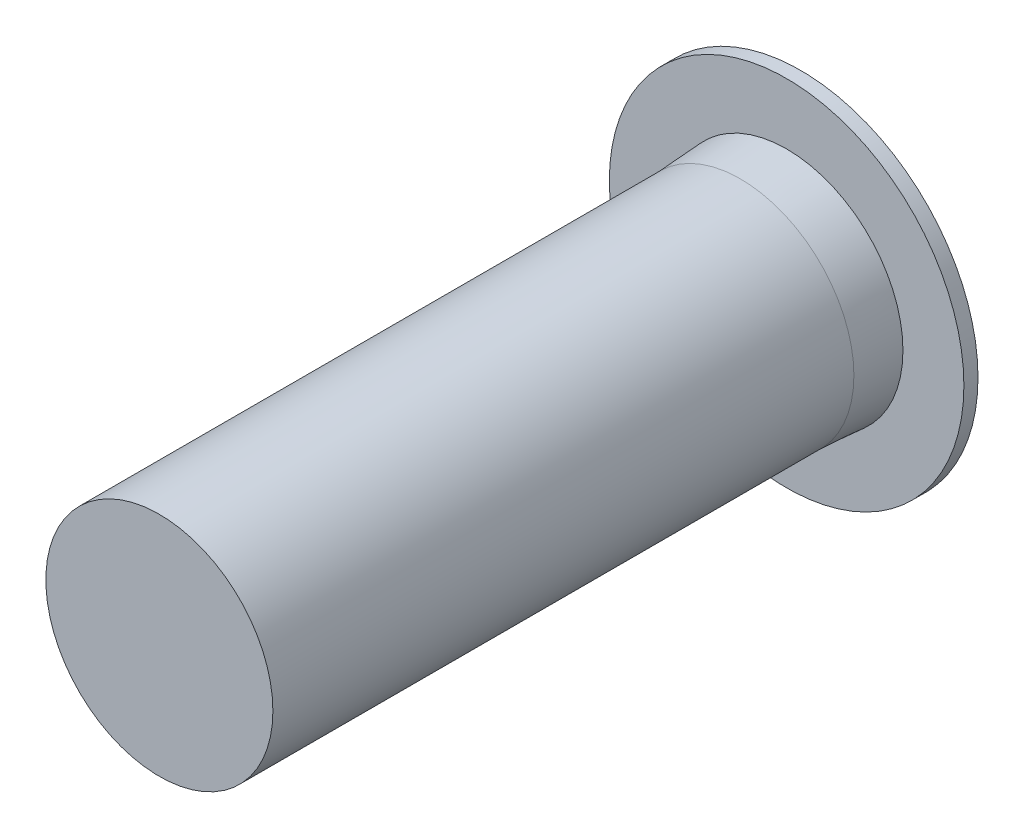
ISO-10303-21;
HEADER;
FILE_DESCRIPTION(('STEP AP214'),'2;1');
FILE_NAME('part.step','',(''),(''),'','','');
FILE_SCHEMA(('AUTOMOTIVE_DESIGN { 1 0 10303 214 1 1 1 1 }'));
ENDSEC;
DATA;
#1=APPLICATION_CONTEXT('core data for automotive mechanical design processes');
#2=APPLICATION_PROTOCOL_DEFINITION('international standard','automotive_design',2000,#1);
#3=PRODUCT_CONTEXT('',#1,'mechanical');
#4=PRODUCT('Part','Part','',(#3));
#5=PRODUCT_RELATED_PRODUCT_CATEGORY('part','',(#4));
#6=PRODUCT_DEFINITION_FORMATION('','',#4);
#7=PRODUCT_DEFINITION_CONTEXT('part definition',#1,'design');
#8=PRODUCT_DEFINITION('design','',#6,#7);
#9=PRODUCT_DEFINITION_SHAPE('','',#8);
#10=(LENGTH_UNIT() NAMED_UNIT(*) SI_UNIT(.MILLI.,.METRE.));
#11=(NAMED_UNIT(*) PLANE_ANGLE_UNIT() SI_UNIT($,.RADIAN.));
#12=(NAMED_UNIT(*) SI_UNIT($,.STERADIAN.) SOLID_ANGLE_UNIT());
#13=UNCERTAINTY_MEASURE_WITH_UNIT(LENGTH_MEASURE(1.E-05),#10,'distance_accuracy_value','');
#14=(GEOMETRIC_REPRESENTATION_CONTEXT(3) GLOBAL_UNCERTAINTY_ASSIGNED_CONTEXT((#13)) GLOBAL_UNIT_ASSIGNED_CONTEXT((#10,
#11,#12)) REPRESENTATION_CONTEXT('',''));
#15=CARTESIAN_POINT('',(0.,0.,0.));
#16=DIRECTION('',(0.,0.,1.));
#17=DIRECTION('',(1.,0.,0.));
#18=AXIS2_PLACEMENT_3D('',#15,#16,#17);
#19=CARTESIAN_POINT('',(0.,0.,2.23));
#20=DIRECTION('',(0.,0.,-1.));
#21=DIRECTION('',(-1.,0.,0.));
#22=AXIS2_PLACEMENT_3D('',#19,#20,#21);
#23=CONICAL_SURFACE('',#22,5.475,0.0604643241418104);
#24=CARTESIAN_POINT('',(0.,0.,2.23));
#25=DIRECTION('',(0.,0.,1.));
#26=DIRECTION('',(1.,0.,0.));
#27=AXIS2_PLACEMENT_3D('',#24,#25,#26);
#28=CIRCLE('',#27,5.475);
#29=CARTESIAN_POINT('',(5.475,0.,2.23));
#30=VERTEX_POINT('',#29);
#31=EDGE_CURVE('E11',#30,#30,#28,.T.);
#32=ORIENTED_EDGE('',*,*,#31,.F.);
#33=EDGE_LOOP('',(#32));
#34=FACE_BOUND('',#33,.T.);
#35=CARTESIAN_POINT('',(0.,0.,0.));
#36=DIRECTION('',(0.,0.,1.));
#37=DIRECTION('',(1.,0.,0.));
#38=AXIS2_PLACEMENT_3D('',#35,#36,#37);
#39=CIRCLE('',#38,5.61);
#40=CARTESIAN_POINT('',(5.61,0.,0.));
#41=VERTEX_POINT('',#40);
#42=EDGE_CURVE('E44',#41,#41,#39,.T.);
#43=ORIENTED_EDGE('',*,*,#42,.T.);
#44=EDGE_LOOP('',(#43));
#45=FACE_BOUND('',#44,.T.);
#46=ADVANCED_FACE('F40',(#34,#45),#23,.T.);
#47=CARTESIAN_POINT('',(0.,0.,30.25));
#48=DIRECTION('',(0.,0.,1.));
#49=DIRECTION('',(1.,0.,0.));
#50=AXIS2_PLACEMENT_3D('',#47,#48,#49);
#51=PLANE('',#50);
#52=CARTESIAN_POINT('',(0.,0.,30.25));
#53=DIRECTION('',(0.,0.,1.));
#54=DIRECTION('',(1.,0.,0.));
#55=AXIS2_PLACEMENT_3D('',#52,#53,#54);
#56=CIRCLE('',#55,5.475);
#57=CARTESIAN_POINT('',(5.475,0.,30.25));
#58=VERTEX_POINT('',#57);
#59=EDGE_CURVE('E48',#58,#58,#56,.T.);
#60=ORIENTED_EDGE('',*,*,#59,.T.);
#61=EDGE_LOOP('',(#60));
#62=FACE_BOUND('',#61,.T.);
#63=ADVANCED_FACE('F74',(#62),#51,.T.);
#64=CARTESIAN_POINT('',(0.,0.,30.25));
#65=DIRECTION('',(0.,0.,-1.));
#66=DIRECTION('',(-1.,0.,0.));
#67=AXIS2_PLACEMENT_3D('',#64,#65,#66);
#68=CYLINDRICAL_SURFACE('',#67,5.475);
#69=ORIENTED_EDGE('',*,*,#31,.T.);
#70=EDGE_LOOP('',(#69));
#71=FACE_BOUND('',#70,.T.);
#72=ORIENTED_EDGE('',*,*,#59,.F.);
#73=EDGE_LOOP('',(#72));
#74=FACE_BOUND('',#73,.T.);
#75=ADVANCED_FACE('F83',(#71,#74),#68,.T.);
#76=CARTESIAN_POINT('',(0.,0.,0.));
#77=DIRECTION('',(0.,0.,-1.));
#78=DIRECTION('',(-1.,0.,0.));
#79=AXIS2_PLACEMENT_3D('',#76,#77,#78);
#80=PLANE('',#79);
#81=CARTESIAN_POINT('',(0.,0.,0.));
#82=DIRECTION('',(0.,0.,-1.));
#83=DIRECTION('',(-1.,0.,0.));
#84=AXIS2_PLACEMENT_3D('',#81,#82,#83);
#85=CIRCLE('',#84,8.55);
#86=CARTESIAN_POINT('',(-8.55,0.,0.));
#87=VERTEX_POINT('',#86);
#88=EDGE_CURVE('E110',#87,#87,#85,.T.);
#89=ORIENTED_EDGE('',*,*,#88,.F.);
#90=EDGE_LOOP('',(#89));
#91=FACE_BOUND('',#90,.T.);
#92=ORIENTED_EDGE('',*,*,#42,.F.);
#93=EDGE_LOOP('',(#92));
#94=FACE_BOUND('',#93,.T.);
#95=ADVANCED_FACE('F89',(#91,#94),#80,.F.);
#96=CARTESIAN_POINT('',(0.,0.,-0.68));
#97=DIRECTION('',(0.,0.,1.));
#98=DIRECTION('',(1.,0.,0.));
#99=AXIS2_PLACEMENT_3D('',#96,#97,#98);
#100=CYLINDRICAL_SURFACE('',#99,8.55);
#101=CARTESIAN_POINT('',(0.,0.,-0.68));
#102=DIRECTION('',(0.,0.,-1.));
#103=DIRECTION('',(-1.,0.,0.));
#104=AXIS2_PLACEMENT_3D('',#101,#102,#103);
#105=CIRCLE('',#104,8.55);
#106=CARTESIAN_POINT('',(-8.55,0.,-0.68));
#107=VERTEX_POINT('',#106);
#108=EDGE_CURVE('E113',#107,#107,#105,.T.);
#109=ORIENTED_EDGE('',*,*,#108,.F.);
#110=EDGE_LOOP('',(#109));
#111=FACE_BOUND('',#110,.T.);
#112=ORIENTED_EDGE('',*,*,#88,.T.);
#113=EDGE_LOOP('',(#112));
#114=FACE_BOUND('',#113,.T.);
#115=ADVANCED_FACE('F85',(#111,#114),#100,.T.);
#116=CARTESIAN_POINT('',(0.,0.,-0.68));
#117=DIRECTION('',(0.,0.,-1.));
#118=DIRECTION('',(-1.,0.,0.));
#119=AXIS2_PLACEMENT_3D('',#116,#117,#118);
#120=PLANE('',#119);
#121=CARTESIAN_POINT('',(0.,0.,-0.68));
#122=DIRECTION('',(0.,0.,-1.));
#123=DIRECTION('',(-1.,0.,0.));
#124=AXIS2_PLACEMENT_3D('',#121,#122,#123);
#125=CIRCLE('',#124,4.92);
#126=CARTESIAN_POINT('',(-4.92,0.,-0.68));
#127=VERTEX_POINT('',#126);
#128=EDGE_CURVE('E117',#127,#127,#125,.T.);
#129=ORIENTED_EDGE('',*,*,#128,.F.);
#130=EDGE_LOOP('',(#129));
#131=FACE_BOUND('',#130,.T.);
#132=ORIENTED_EDGE('',*,*,#108,.T.);
#133=EDGE_LOOP('',(#132));
#134=FACE_BOUND('',#133,.T.);
#135=ADVANCED_FACE('F128',(#131,#134),#120,.T.);
#136=CARTESIAN_POINT('',(0.,0.,15.89));
#137=DIRECTION('',(0.,0.,-1.));
#138=DIRECTION('',(-1.,0.,0.));
#139=AXIS2_PLACEMENT_3D('',#136,#137,#138);
#140=CYLINDRICAL_SURFACE('',#139,4.92);
#141=CARTESIAN_POINT('',(0.,0.,15.89));
#142=DIRECTION('',(0.,0.,-1.));
#143=DIRECTION('',(-1.,0.,0.));
#144=AXIS2_PLACEMENT_3D('',#141,#142,#143);
#145=CIRCLE('',#144,4.92);
#146=CARTESIAN_POINT('',(-4.92,0.,15.89));
#147=VERTEX_POINT('',#146);
#148=EDGE_CURVE('E114',#147,#147,#145,.T.);
#149=ORIENTED_EDGE('',*,*,#148,.F.);
#150=EDGE_LOOP('',(#149));
#151=FACE_BOUND('',#150,.T.);
#152=ORIENTED_EDGE('',*,*,#128,.T.);
#153=EDGE_LOOP('',(#152));
#154=FACE_BOUND('',#153,.T.);
#155=ADVANCED_FACE('F125',(#151,#154),#140,.F.);
#156=CARTESIAN_POINT('',(0.,0.,15.89));
#157=DIRECTION('',(0.,0.,-1.));
#158=DIRECTION('',(-1.,0.,0.));
#159=AXIS2_PLACEMENT_3D('',#156,#157,#158);
#160=PLANE('',#159);
#161=ORIENTED_EDGE('',*,*,#148,.T.);
#162=EDGE_LOOP('',(#161));
#163=FACE_BOUND('',#162,.T.);
#164=ADVANCED_FACE('F123',(#163),#160,.T.);
#165=CLOSED_SHELL('',(#46,#63,#75,#95,#115,#135,#155,#164));
#166=MANIFOLD_SOLID_BREP('B2',#165);
#167=ADVANCED_BREP_SHAPE_REPRESENTATION('',(#18,#166),#14);
#168=SHAPE_DEFINITION_REPRESENTATION(#9,#167);
ENDSEC;
END-ISO-10303-21;
